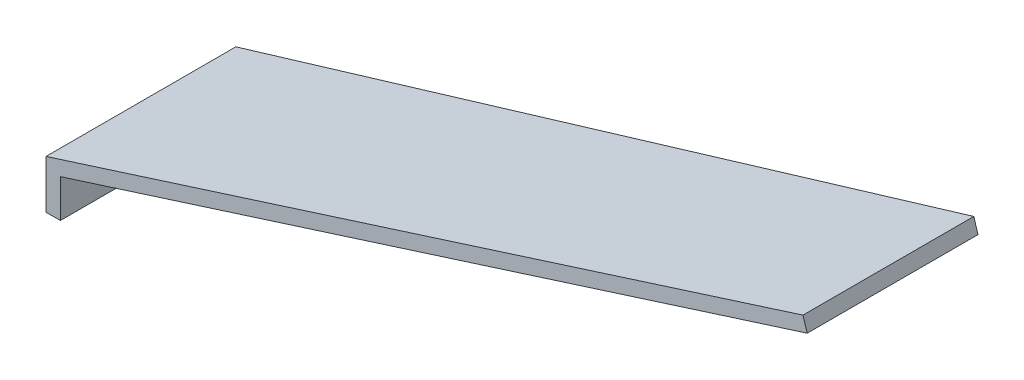
ISO-10303-21;
HEADER;
FILE_DESCRIPTION(('STEP AP214'),'2;1');
FILE_NAME('part.step','',(''),(''),'','','');
FILE_SCHEMA(('AUTOMOTIVE_DESIGN { 1 0 10303 214 1 1 1 1 }'));
ENDSEC;
DATA;
#1=APPLICATION_CONTEXT('core data for automotive mechanical design processes');
#2=APPLICATION_PROTOCOL_DEFINITION('international standard','automotive_design',2000,#1);
#3=PRODUCT_CONTEXT('',#1,'mechanical');
#4=PRODUCT('Part','Part','',(#3));
#5=PRODUCT_RELATED_PRODUCT_CATEGORY('part','',(#4));
#6=PRODUCT_DEFINITION_FORMATION('','',#4);
#7=PRODUCT_DEFINITION_CONTEXT('part definition',#1,'design');
#8=PRODUCT_DEFINITION('design','',#6,#7);
#9=PRODUCT_DEFINITION_SHAPE('','',#8);
#10=(LENGTH_UNIT() NAMED_UNIT(*) SI_UNIT(.MILLI.,.METRE.));
#11=(NAMED_UNIT(*) PLANE_ANGLE_UNIT() SI_UNIT($,.RADIAN.));
#12=(NAMED_UNIT(*) SI_UNIT($,.STERADIAN.) SOLID_ANGLE_UNIT());
#13=UNCERTAINTY_MEASURE_WITH_UNIT(LENGTH_MEASURE(1.E-05),#10,'distance_accuracy_value','');
#14=(GEOMETRIC_REPRESENTATION_CONTEXT(3) GLOBAL_UNCERTAINTY_ASSIGNED_CONTEXT((#13)) GLOBAL_UNIT_ASSIGNED_CONTEXT((#10,
#11,#12)) REPRESENTATION_CONTEXT('',''));
#15=CARTESIAN_POINT('',(0.,0.,0.));
#16=DIRECTION('',(0.,0.,1.));
#17=DIRECTION('',(1.,0.,0.));
#18=AXIS2_PLACEMENT_3D('',#15,#16,#17);
#19=CARTESIAN_POINT('',(0.,0.8,2.));
#20=DIRECTION('',(-0.295927265060346,0.955210476174704,0.));
#21=DIRECTION('',(-0.955210476174704,-0.295927265060346,0.));
#22=AXIS2_PLACEMENT_3D('',#19,#20,#21);
#23=PLANE('',#22);
#24=DIRECTION('',(0.955140199389065,0.295905493087058,-0.012130073038637));
#25=VECTOR('',#24,1.);
#26=CARTESIAN_POINT('',(-4.41416015768008E-05,0.799986324790446,1.99619062576042));
#27=LINE('',#26,#25);
#28=CARTESIAN_POINT('',(0.,0.8,1.99619006517167));
#29=VERTEX_POINT('',#28);
#30=CARTESIAN_POINT('',(15.5370790569609,5.61343685714759,1.7988725364062));
#31=VERTEX_POINT('',#30);
#32=EDGE_CURVE('E117',#29,#31,#27,.T.);
#33=ORIENTED_EDGE('',*,*,#32,.F.);
#34=DIRECTION('',(0.,0.,-1.));
#35=VECTOR('',#34,1.);
#36=CARTESIAN_POINT('',(0.,0.8,2.));
#37=LINE('',#36,#35);
#38=CARTESIAN_POINT('',(0.,0.8,-1.99619006517167));
#39=VERTEX_POINT('',#38);
#40=EDGE_CURVE('E74',#29,#39,#37,.T.);
#41=ORIENTED_EDGE('',*,*,#40,.T.);
#42=DIRECTION('',(-0.955140199389065,-0.295905493087058,-0.012130073038637));
#43=VECTOR('',#42,1.);
#44=CARTESIAN_POINT('',(0.046299539921334,0.814343745765166,-1.99560207107273));
#45=LINE('',#44,#43);
#46=CARTESIAN_POINT('',(15.5370790569609,5.61343685714759,-1.7988725364062));
#47=VERTEX_POINT('',#46);
#48=EDGE_CURVE('E108',#47,#39,#45,.T.);
#49=ORIENTED_EDGE('',*,*,#48,.F.);
#50=DIRECTION('',(0.,0.,-1.));
#51=VECTOR('',#50,1.);
#52=CARTESIAN_POINT('',(15.5370790569609,5.61343685714759,2.));
#53=LINE('',#52,#51);
#54=EDGE_CURVE('E10',#31,#47,#53,.T.);
#55=ORIENTED_EDGE('',*,*,#54,.F.);
#56=EDGE_LOOP('',(#33,#41,#49,#55));
#57=FACE_BOUND('',#56,.T.);
#58=ADVANCED_FACE('F16',(#57),#23,.F.);
#59=CARTESIAN_POINT('',(15.4483008774428,5.9,2.));
#60=DIRECTION('',(-0.955210476174704,-0.295927265060344,0.));
#61=DIRECTION('',(0.295927265060344,-0.955210476174704,0.));
#62=AXIS2_PLACEMENT_3D('',#59,#60,#61);
#63=PLANE('',#62);
#64=DIRECTION('',(-0.295925175220864,0.955203730474661,0.0037581854388461));
#65=VECTOR('',#64,1.);
#66=CARTESIAN_POINT('',(15.4480784491059,5.9007179665502,1.80000282479156));
#67=LINE('',#66,#65);
#68=CARTESIAN_POINT('',(15.4483008774428,5.9,1.8));
#69=VERTEX_POINT('',#68);
#70=EDGE_CURVE('E124',#31,#69,#67,.T.);
#71=ORIENTED_EDGE('',*,*,#70,.F.);
#72=ORIENTED_EDGE('',*,*,#54,.T.);
#73=DIRECTION('',(0.295925175220864,-0.955203730474661,0.0037581854388461));
#74=VECTOR('',#73,1.);
#75=CARTESIAN_POINT('',(15.4525270158439,5.8863586355462,-1.79994632896039));
#76=LINE('',#75,#74);
#77=CARTESIAN_POINT('',(15.4483008774428,5.9,-1.8));
#78=VERTEX_POINT('',#77);
#79=EDGE_CURVE('E103',#78,#47,#76,.T.);
#80=ORIENTED_EDGE('',*,*,#79,.F.);
#81=DIRECTION('',(0.,0.,-1.));
#82=VECTOR('',#81,1.);
#83=CARTESIAN_POINT('',(15.4483008774428,5.9,2.));
#84=LINE('',#83,#82);
#85=EDGE_CURVE('E23',#69,#78,#84,.T.);
#86=ORIENTED_EDGE('',*,*,#85,.F.);
#87=EDGE_LOOP('',(#71,#72,#80,#86));
#88=FACE_BOUND('',#87,.T.);
#89=ADVANCED_FACE('F106',(#88),#63,.F.);
#90=CARTESIAN_POINT('',(-0.3,1.02112594632313,2.));
#91=DIRECTION('',(0.295927265060346,-0.955210476174704,0.));
#92=DIRECTION('',(0.955210476174704,0.295927265060346,0.));
#93=AXIS2_PLACEMENT_3D('',#90,#91,#92);
#94=PLANE('',#93);
#95=DIRECTION('',(-0.955140199389065,-0.295905493087058,0.012130073038637));
#96=VECTOR('',#95,1.);
#97=CARTESIAN_POINT('',(-0.3,1.02112594632313,2.));
#98=LINE('',#97,#96);
#99=CARTESIAN_POINT('',(-0.3,1.02112594632313,2.));
#100=VERTEX_POINT('',#99);
#101=EDGE_CURVE('E30',#69,#100,#98,.T.);
#102=ORIENTED_EDGE('',*,*,#101,.F.);
#103=ORIENTED_EDGE('',*,*,#85,.T.);
#104=DIRECTION('',(0.955140199389065,0.295905493087058,0.012130073038637));
#105=VECTOR('',#104,1.);
#106=CARTESIAN_POINT('',(-0.253656318477089,1.03548336729785,-1.99941144531231));
#107=LINE('',#106,#105);
#108=CARTESIAN_POINT('',(-0.3,1.02112594632313,-2.));
#109=VERTEX_POINT('',#108);
#110=EDGE_CURVE('E96',#109,#78,#107,.T.);
#111=ORIENTED_EDGE('',*,*,#110,.F.);
#112=DIRECTION('',(0.,0.,-1.));
#113=VECTOR('',#112,1.);
#114=CARTESIAN_POINT('',(-0.3,1.02112594632313,2.));
#115=LINE('',#114,#113);
#116=EDGE_CURVE('E86',#100,#109,#115,.T.);
#117=ORIENTED_EDGE('',*,*,#116,.F.);
#118=EDGE_LOOP('',(#102,#103,#111,#117));
#119=FACE_BOUND('',#118,.T.);
#120=ADVANCED_FACE('F95',(#119),#94,.F.);
#121=CARTESIAN_POINT('',(0.,0.,2.));
#122=DIRECTION('',(0.,1.,0.));
#123=DIRECTION('',(-1.,0.,0.));
#124=AXIS2_PLACEMENT_3D('',#121,#122,#123);
#125=PLANE('',#124);
#126=DIRECTION('',(-0.999919367512356,0.,0.0126987587460257));
#127=VECTOR('',#126,1.);
#128=CARTESIAN_POINT('',(-0.3,0.,2.));
#129=LINE('',#128,#127);
#130=CARTESIAN_POINT('',(0.,0.,1.99619006517167));
#131=VERTEX_POINT('',#130);
#132=CARTESIAN_POINT('',(-0.3,0.,2.));
#133=VERTEX_POINT('',#132);
#134=EDGE_CURVE('E69',#131,#133,#129,.T.);
#135=ORIENTED_EDGE('',*,*,#134,.T.);
#136=DIRECTION('',(0.,0.,-1.));
#137=VECTOR('',#136,1.);
#138=CARTESIAN_POINT('',(-0.3,0.,2.));
#139=LINE('',#138,#137);
#140=CARTESIAN_POINT('',(-0.3,0.,-2.));
#141=VERTEX_POINT('',#140);
#142=EDGE_CURVE('E81',#133,#141,#139,.T.);
#143=ORIENTED_EDGE('',*,*,#142,.T.);
#144=DIRECTION('',(0.999919367512356,0.,0.0126987587460257));
#145=VECTOR('',#144,1.);
#146=CARTESIAN_POINT('',(-0.3,0.,-2.));
#147=LINE('',#146,#145);
#148=CARTESIAN_POINT('',(0.,0.,-1.99619006517167));
#149=VERTEX_POINT('',#148);
#150=EDGE_CURVE('E38',#141,#149,#147,.T.);
#151=ORIENTED_EDGE('',*,*,#150,.T.);
#152=DIRECTION('',(0.,0.,-1.));
#153=VECTOR('',#152,1.);
#154=CARTESIAN_POINT('',(0.,0.,2.));
#155=LINE('',#154,#153);
#156=EDGE_CURVE('E82',#131,#149,#155,.T.);
#157=ORIENTED_EDGE('',*,*,#156,.F.);
#158=EDGE_LOOP('',(#135,#143,#151,#157));
#159=FACE_BOUND('',#158,.T.);
#160=ADVANCED_FACE('F80',(#159),#125,.F.);
#161=CARTESIAN_POINT('',(0.,0.,2.));
#162=DIRECTION('',(-1.,0.,0.));
#163=DIRECTION('',(0.,0.,1.));
#164=AXIS2_PLACEMENT_3D('',#161,#162,#163);
#165=PLANE('',#164);
#166=DIRECTION('',(0.,1.,0.));
#167=VECTOR('',#166,1.);
#168=CARTESIAN_POINT('',(0.,0.,1.99619006517167));
#169=LINE('',#168,#167);
#170=EDGE_CURVE('E83',#131,#29,#169,.T.);
#171=ORIENTED_EDGE('',*,*,#170,.F.);
#172=ORIENTED_EDGE('',*,*,#156,.T.);
#173=DIRECTION('',(0.,-1.,0.));
#174=VECTOR('',#173,1.);
#175=CARTESIAN_POINT('',(0.,0.,-1.99619006517167));
#176=LINE('',#175,#174);
#177=EDGE_CURVE('E110',#39,#149,#176,.T.);
#178=ORIENTED_EDGE('',*,*,#177,.F.);
#179=ORIENTED_EDGE('',*,*,#40,.F.);
#180=EDGE_LOOP('',(#171,#172,#178,#179));
#181=FACE_BOUND('',#180,.T.);
#182=ADVANCED_FACE('F120',(#181),#165,.F.);
#183=CARTESIAN_POINT('',(-0.3,1.02112594632313,2.));
#184=DIRECTION('',(1.,0.,0.));
#185=DIRECTION('',(0.,1.,0.));
#186=AXIS2_PLACEMENT_3D('',#183,#184,#185);
#187=PLANE('',#186);
#188=DIRECTION('',(0.,-1.,0.));
#189=VECTOR('',#188,1.);
#190=CARTESIAN_POINT('',(-0.3,1.02112594632313,-2.));
#191=LINE('',#190,#189);
#192=EDGE_CURVE('E75',#109,#141,#191,.T.);
#193=ORIENTED_EDGE('',*,*,#192,.T.);
#194=ORIENTED_EDGE('',*,*,#142,.F.);
#195=DIRECTION('',(0.,-1.,0.));
#196=VECTOR('',#195,1.);
#197=CARTESIAN_POINT('',(-0.3,1.02112594632313,2.));
#198=LINE('',#197,#196);
#199=EDGE_CURVE('E66',#100,#133,#198,.T.);
#200=ORIENTED_EDGE('',*,*,#199,.F.);
#201=ORIENTED_EDGE('',*,*,#116,.T.);
#202=EDGE_LOOP('',(#193,#194,#200,#201));
#203=FACE_BOUND('',#202,.T.);
#204=ADVANCED_FACE('F85',(#203),#187,.F.);
#205=CARTESIAN_POINT('',(-0.3,5.9,-2.));
#206=DIRECTION('',(0.0126987587460257,0.,-0.999919367512356));
#207=DIRECTION('',(-0.999919367512356,0.,-0.0126987587460257));
#208=AXIS2_PLACEMENT_3D('',#205,#206,#207);
#209=PLANE('',#208);
#210=ORIENTED_EDGE('',*,*,#110,.T.);
#211=ORIENTED_EDGE('',*,*,#79,.T.);
#212=ORIENTED_EDGE('',*,*,#48,.T.);
#213=ORIENTED_EDGE('',*,*,#177,.T.);
#214=ORIENTED_EDGE('',*,*,#150,.F.);
#215=ORIENTED_EDGE('',*,*,#192,.F.);
#216=EDGE_LOOP('',(#210,#211,#212,#213,#214,#215));
#217=FACE_BOUND('',#216,.T.);
#218=ADVANCED_FACE('F101',(#217),#209,.T.);
#219=CARTESIAN_POINT('',(-0.3,5.9,2.));
#220=DIRECTION('',(0.0126987587460257,0.,0.999919367512356));
#221=DIRECTION('',(0.999919367512356,0.,-0.0126987587460257));
#222=AXIS2_PLACEMENT_3D('',#219,#220,#221);
#223=PLANE('',#222);
#224=ORIENTED_EDGE('',*,*,#101,.T.);
#225=ORIENTED_EDGE('',*,*,#199,.T.);
#226=ORIENTED_EDGE('',*,*,#134,.F.);
#227=ORIENTED_EDGE('',*,*,#170,.T.);
#228=ORIENTED_EDGE('',*,*,#32,.T.);
#229=ORIENTED_EDGE('',*,*,#70,.T.);
#230=EDGE_LOOP('',(#224,#225,#226,#227,#228,#229));
#231=FACE_BOUND('',#230,.T.);
#232=ADVANCED_FACE('F68',(#231),#223,.T.);
#233=CLOSED_SHELL('',(#58,#89,#120,#160,#182,#204,#218,#232));
#234=MANIFOLD_SOLID_BREP('B1',#233);
#235=ADVANCED_BREP_SHAPE_REPRESENTATION('',(#18,#234),#14);
#236=SHAPE_DEFINITION_REPRESENTATION(#9,#235);
ENDSEC;
END-ISO-10303-21;
